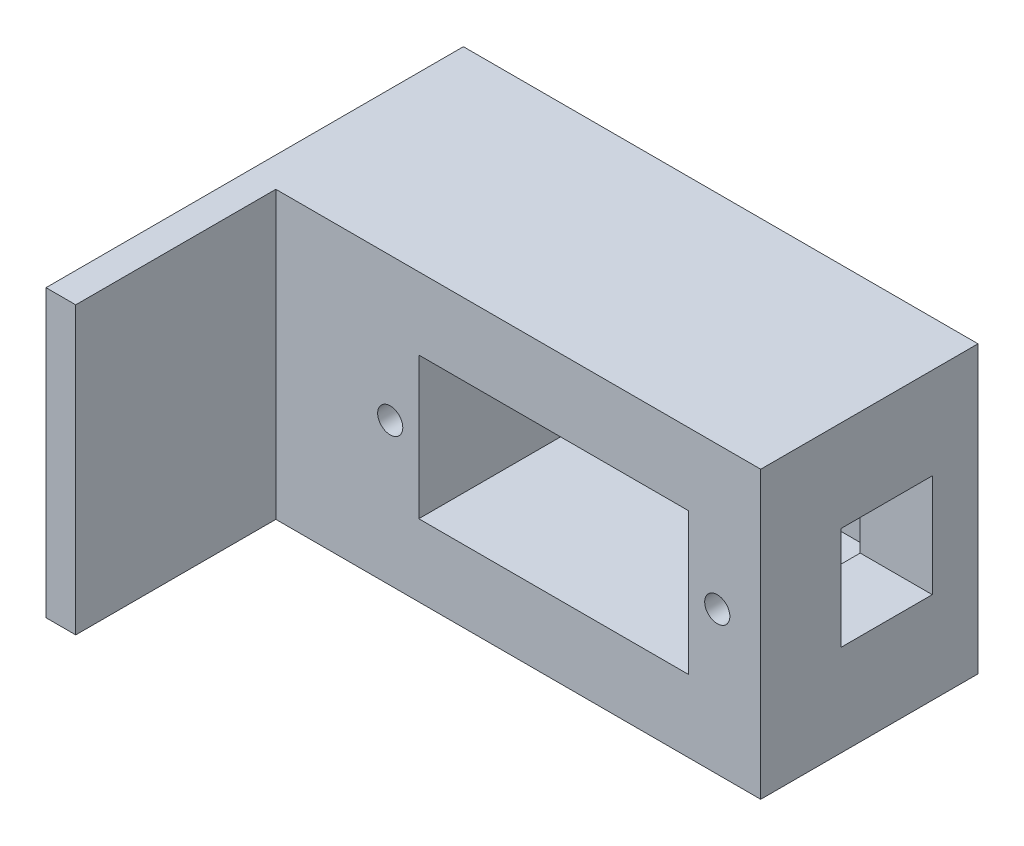
ISO-10303-21;
HEADER;
FILE_DESCRIPTION(('STEP AP214'),'2;1');
FILE_NAME('part.step','',(''),(''),'','','');
FILE_SCHEMA(('AUTOMOTIVE_DESIGN { 1 0 10303 214 1 1 1 1 }'));
ENDSEC;
DATA;
#1=APPLICATION_CONTEXT('core data for automotive mechanical design processes');
#2=APPLICATION_PROTOCOL_DEFINITION('international standard','automotive_design',2000,#1);
#3=PRODUCT_CONTEXT('',#1,'mechanical');
#4=PRODUCT('Part','Part','',(#3));
#5=PRODUCT_RELATED_PRODUCT_CATEGORY('part','',(#4));
#6=PRODUCT_DEFINITION_FORMATION('','',#4);
#7=PRODUCT_DEFINITION_CONTEXT('part definition',#1,'design');
#8=PRODUCT_DEFINITION('design','',#6,#7);
#9=PRODUCT_DEFINITION_SHAPE('','',#8);
#10=(LENGTH_UNIT() NAMED_UNIT(*) SI_UNIT(.MILLI.,.METRE.));
#11=(NAMED_UNIT(*) PLANE_ANGLE_UNIT() SI_UNIT($,.RADIAN.));
#12=(NAMED_UNIT(*) SI_UNIT($,.STERADIAN.) SOLID_ANGLE_UNIT());
#13=UNCERTAINTY_MEASURE_WITH_UNIT(LENGTH_MEASURE(1.E-05),#10,'distance_accuracy_value','');
#14=(GEOMETRIC_REPRESENTATION_CONTEXT(3) GLOBAL_UNCERTAINTY_ASSIGNED_CONTEXT((#13)) GLOBAL_UNIT_ASSIGNED_CONTEXT((#10,
#11,#12)) REPRESENTATION_CONTEXT('',''));
#15=CARTESIAN_POINT('',(0.,0.,0.));
#16=DIRECTION('',(0.,0.,1.));
#17=DIRECTION('',(1.,0.,0.));
#18=AXIS2_PLACEMENT_3D('',#15,#16,#17);
#19=CARTESIAN_POINT('',(-65.0289916908456,-17.09643110089,19.));
#20=DIRECTION('',(0.,1.,0.));
#21=DIRECTION('',(0.,0.,1.));
#22=AXIS2_PLACEMENT_3D('',#19,#20,#21);
#23=PLANE('',#22);
#24=DIRECTION('',(1.,0.,0.));
#25=VECTOR('',#24,1.);
#26=CARTESIAN_POINT('',(-65.0289916908456,-17.09643110089,0.));
#27=LINE('',#26,#25);
#28=CARTESIAN_POINT('',(-65.0289916908456,-17.09643110089,0.));
#29=VERTEX_POINT('',#28);
#30=CARTESIAN_POINT('',(-20.0289916908456,-17.09643110089,0.));
#31=VERTEX_POINT('',#30);
#32=EDGE_CURVE('E250',#29,#31,#27,.T.);
#33=ORIENTED_EDGE('',*,*,#32,.T.);
#34=DIRECTION('',(0.,0.,-1.));
#35=VECTOR('',#34,1.);
#36=CARTESIAN_POINT('',(-20.0289916908456,-17.09643110089,19.));
#37=LINE('',#36,#35);
#38=CARTESIAN_POINT('',(-20.0289916908456,-17.09643110089,19.));
#39=VERTEX_POINT('',#38);
#40=EDGE_CURVE('E291',#39,#31,#37,.T.);
#41=ORIENTED_EDGE('',*,*,#40,.F.);
#42=DIRECTION('',(1.,0.,0.));
#43=VECTOR('',#42,1.);
#44=CARTESIAN_POINT('',(-65.0289916908456,-17.09643110089,19.));
#45=LINE('',#44,#43);
#46=CARTESIAN_POINT('',(-62.4289916908456,-17.09643110089,19.));
#47=VERTEX_POINT('',#46);
#48=EDGE_CURVE('E160',#47,#39,#45,.T.);
#49=ORIENTED_EDGE('',*,*,#48,.F.);
#50=DIRECTION('',(0.,0.,-1.));
#51=VECTOR('',#50,1.);
#52=CARTESIAN_POINT('',(-62.4289916908456,-17.09643110089,36.5));
#53=LINE('',#52,#51);
#54=CARTESIAN_POINT('',(-62.4289916908456,-17.09643110089,36.5));
#55=VERTEX_POINT('',#54);
#56=EDGE_CURVE('E55',#55,#47,#53,.T.);
#57=ORIENTED_EDGE('',*,*,#56,.F.);
#58=DIRECTION('',(1.,0.,0.));
#59=VECTOR('',#58,1.);
#60=CARTESIAN_POINT('',(-65.0289916908456,-17.09643110089,36.5));
#61=LINE('',#60,#59);
#62=CARTESIAN_POINT('',(-65.0289916908456,-17.09643110089,36.5));
#63=VERTEX_POINT('',#62);
#64=EDGE_CURVE('E145',#63,#55,#61,.T.);
#65=ORIENTED_EDGE('',*,*,#64,.F.);
#66=DIRECTION('',(0.,0.,-1.));
#67=VECTOR('',#66,1.);
#68=CARTESIAN_POINT('',(-65.0289916908456,-17.09643110089,19.));
#69=LINE('',#68,#67);
#70=EDGE_CURVE('E270',#63,#29,#69,.T.);
#71=ORIENTED_EDGE('',*,*,#70,.T.);
#72=EDGE_LOOP('',(#33,#41,#49,#57,#65,#71));
#73=FACE_BOUND('',#72,.T.);
#74=ADVANCED_FACE('F39',(#73),#23,.F.);
#75=CARTESIAN_POINT('',(-20.0289916908456,7.90356889910998,19.));
#76=DIRECTION('',(1.,0.,0.));
#77=DIRECTION('',(0.,0.,-1.));
#78=AXIS2_PLACEMENT_3D('',#75,#76,#77);
#79=PLANE('',#78);
#80=DIRECTION('',(0.,-1.,0.));
#81=VECTOR('',#80,1.);
#82=CARTESIAN_POINT('',(-20.0289916908456,-0.0964311008900161,12.));
#83=LINE('',#82,#81);
#84=CARTESIAN_POINT('',(-20.0289916908456,-0.0964311008900161,12.));
#85=VERTEX_POINT('',#84);
#86=CARTESIAN_POINT('',(-20.0289916908456,-9.09643110089002,12.));
#87=VERTEX_POINT('',#86);
#88=EDGE_CURVE('E63',#85,#87,#83,.T.);
#89=ORIENTED_EDGE('',*,*,#88,.F.);
#90=DIRECTION('',(0.,0.,1.));
#91=VECTOR('',#90,1.);
#92=CARTESIAN_POINT('',(-20.0289916908456,-0.0964311008900161,12.));
#93=LINE('',#92,#91);
#94=CARTESIAN_POINT('',(-20.0289916908456,-0.0964311008900161,4.));
#95=VERTEX_POINT('',#94);
#96=EDGE_CURVE('E199',#95,#85,#93,.T.);
#97=ORIENTED_EDGE('',*,*,#96,.F.);
#98=DIRECTION('',(0.,1.,0.));
#99=VECTOR('',#98,1.);
#100=CARTESIAN_POINT('',(-20.0289916908456,-0.0964311008900161,4.));
#101=LINE('',#100,#99);
#102=CARTESIAN_POINT('',(-20.0289916908456,-9.09643110089002,4.));
#103=VERTEX_POINT('',#102);
#104=EDGE_CURVE('E195',#103,#95,#101,.T.);
#105=ORIENTED_EDGE('',*,*,#104,.F.);
#106=DIRECTION('',(0.,0.,-1.));
#107=VECTOR('',#106,1.);
#108=CARTESIAN_POINT('',(-20.0289916908456,-9.09643110089002,12.));
#109=LINE('',#108,#107);
#110=EDGE_CURVE('E191',#87,#103,#109,.T.);
#111=ORIENTED_EDGE('',*,*,#110,.F.);
#112=EDGE_LOOP('',(#89,#97,#105,#111));
#113=FACE_BOUND('',#112,.T.);
#114=DIRECTION('',(0.,-1.,0.));
#115=VECTOR('',#114,1.);
#116=CARTESIAN_POINT('',(-20.0289916908456,7.90356889910998,0.));
#117=LINE('',#116,#115);
#118=CARTESIAN_POINT('',(-20.0289916908456,7.90356889910998,0.));
#119=VERTEX_POINT('',#118);
#120=EDGE_CURVE('E273',#119,#31,#117,.T.);
#121=ORIENTED_EDGE('',*,*,#120,.F.);
#122=DIRECTION('',(0.,0.,-1.));
#123=VECTOR('',#122,1.);
#124=CARTESIAN_POINT('',(-20.0289916908456,7.90356889910998,19.));
#125=LINE('',#124,#123);
#126=CARTESIAN_POINT('',(-20.0289916908456,7.90356889910998,19.));
#127=VERTEX_POINT('',#126);
#128=EDGE_CURVE('E288',#127,#119,#125,.T.);
#129=ORIENTED_EDGE('',*,*,#128,.F.);
#130=DIRECTION('',(0.,-1.,0.));
#131=VECTOR('',#130,1.);
#132=CARTESIAN_POINT('',(-20.0289916908456,7.90356889910998,19.));
#133=LINE('',#132,#131);
#134=EDGE_CURVE('E262',#127,#39,#133,.T.);
#135=ORIENTED_EDGE('',*,*,#134,.T.);
#136=ORIENTED_EDGE('',*,*,#40,.T.);
#137=EDGE_LOOP('',(#121,#129,#135,#136));
#138=FACE_BOUND('',#137,.T.);
#139=ADVANCED_FACE('F318',(#113,#138),#79,.T.);
#140=CARTESIAN_POINT('',(-65.0289916908456,7.90356889910998,19.));
#141=DIRECTION('',(0.,1.,0.));
#142=DIRECTION('',(0.,0.,1.));
#143=AXIS2_PLACEMENT_3D('',#140,#141,#142);
#144=PLANE('',#143);
#145=DIRECTION('',(1.,0.,0.));
#146=VECTOR('',#145,1.);
#147=CARTESIAN_POINT('',(-65.0289916908456,7.90356889910998,0.));
#148=LINE('',#147,#146);
#149=CARTESIAN_POINT('',(-65.0289916908456,7.90356889910998,0.));
#150=VERTEX_POINT('',#149);
#151=EDGE_CURVE('E277',#150,#119,#148,.T.);
#152=ORIENTED_EDGE('',*,*,#151,.F.);
#153=DIRECTION('',(0.,0.,-1.));
#154=VECTOR('',#153,1.);
#155=CARTESIAN_POINT('',(-65.0289916908456,7.90356889910998,19.));
#156=LINE('',#155,#154);
#157=CARTESIAN_POINT('',(-65.0289916908456,7.90356889910998,36.5));
#158=VERTEX_POINT('',#157);
#159=EDGE_CURVE('E285',#158,#150,#156,.T.);
#160=ORIENTED_EDGE('',*,*,#159,.F.);
#161=DIRECTION('',(1.,0.,0.));
#162=VECTOR('',#161,1.);
#163=CARTESIAN_POINT('',(-65.0289916908456,7.90356889910998,36.5));
#164=LINE('',#163,#162);
#165=CARTESIAN_POINT('',(-62.4289916908456,7.90356889910998,36.5));
#166=VERTEX_POINT('',#165);
#167=EDGE_CURVE('E167',#158,#166,#164,.T.);
#168=ORIENTED_EDGE('',*,*,#167,.T.);
#169=DIRECTION('',(0.,0.,-1.));
#170=VECTOR('',#169,1.);
#171=CARTESIAN_POINT('',(-62.4289916908456,7.90356889910998,36.5));
#172=LINE('',#171,#170);
#173=CARTESIAN_POINT('',(-62.4289916908456,7.90356889910998,19.));
#174=VERTEX_POINT('',#173);
#175=EDGE_CURVE('E163',#166,#174,#172,.T.);
#176=ORIENTED_EDGE('',*,*,#175,.T.);
#177=DIRECTION('',(1.,0.,0.));
#178=VECTOR('',#177,1.);
#179=CARTESIAN_POINT('',(-65.0289916908456,7.90356889910998,19.));
#180=LINE('',#179,#178);
#181=EDGE_CURVE('E267',#174,#127,#180,.T.);
#182=ORIENTED_EDGE('',*,*,#181,.T.);
#183=ORIENTED_EDGE('',*,*,#128,.T.);
#184=EDGE_LOOP('',(#152,#160,#168,#176,#182,#183));
#185=FACE_BOUND('',#184,.T.);
#186=ADVANCED_FACE('F341',(#185),#144,.T.);
#187=CARTESIAN_POINT('',(-65.0289916908456,7.90356889910998,19.));
#188=DIRECTION('',(1.,0.,0.));
#189=DIRECTION('',(0.,0.,-1.));
#190=AXIS2_PLACEMENT_3D('',#187,#188,#189);
#191=PLANE('',#190);
#192=DIRECTION('',(0.,-1.,0.));
#193=VECTOR('',#192,1.);
#194=CARTESIAN_POINT('',(-65.0289916908456,7.90356889910998,0.));
#195=LINE('',#194,#193);
#196=EDGE_CURVE('E263',#150,#29,#195,.T.);
#197=ORIENTED_EDGE('',*,*,#196,.T.);
#198=ORIENTED_EDGE('',*,*,#70,.F.);
#199=DIRECTION('',(0.,-1.,0.));
#200=VECTOR('',#199,1.);
#201=CARTESIAN_POINT('',(-65.0289916908456,7.90356889910998,36.5));
#202=LINE('',#201,#200);
#203=EDGE_CURVE('E151',#158,#63,#202,.T.);
#204=ORIENTED_EDGE('',*,*,#203,.F.);
#205=ORIENTED_EDGE('',*,*,#159,.T.);
#206=EDGE_LOOP('',(#197,#198,#204,#205));
#207=FACE_BOUND('',#206,.T.);
#208=ADVANCED_FACE('F345',(#207),#191,.F.);
#209=CARTESIAN_POINT('',(0.,0.,19.));
#210=DIRECTION('',(0.,0.,-1.));
#211=DIRECTION('',(-1.,0.,0.));
#212=AXIS2_PLACEMENT_3D('',#209,#210,#211);
#213=PLANE('',#212);
#214=CARTESIAN_POINT('',(-52.4289916908457,-4.59643110089002,19.));
#215=DIRECTION('',(0.,0.,1.));
#216=DIRECTION('',(1.,0.,0.));
#217=AXIS2_PLACEMENT_3D('',#214,#215,#216);
#218=CIRCLE('',#217,1.1);
#219=CARTESIAN_POINT('',(-51.3289916908457,-4.59643110089002,19.));
#220=VERTEX_POINT('',#219);
#221=EDGE_CURVE('E182',#220,#220,#218,.T.);
#222=ORIENTED_EDGE('',*,*,#221,.F.);
#223=EDGE_LOOP('',(#222));
#224=FACE_BOUND('',#223,.T.);
#225=CARTESIAN_POINT('',(-23.8289916908456,-4.59643110089002,19.));
#226=DIRECTION('',(0.,0.,1.));
#227=DIRECTION('',(1.,0.,0.));
#228=AXIS2_PLACEMENT_3D('',#225,#226,#227);
#229=CIRCLE('',#228,1.1);
#230=CARTESIAN_POINT('',(-22.7289916908456,-4.59643110089002,19.));
#231=VERTEX_POINT('',#230);
#232=EDGE_CURVE('E162',#231,#231,#229,.T.);
#233=ORIENTED_EDGE('',*,*,#232,.F.);
#234=EDGE_LOOP('',(#233));
#235=FACE_BOUND('',#234,.T.);
#236=DIRECTION('',(1.,0.,0.));
#237=VECTOR('',#236,1.);
#238=CARTESIAN_POINT('',(-49.9289916908456,-10.79643110089,19.));
#239=LINE('',#238,#237);
#240=CARTESIAN_POINT('',(-49.9289916908456,-10.79643110089,19.));
#241=VERTEX_POINT('',#240);
#242=CARTESIAN_POINT('',(-26.3289916908456,-10.79643110089,19.));
#243=VERTEX_POINT('',#242);
#244=EDGE_CURVE('E236',#241,#243,#239,.T.);
#245=ORIENTED_EDGE('',*,*,#244,.F.);
#246=DIRECTION('',(0.,-1.,0.));
#247=VECTOR('',#246,1.);
#248=CARTESIAN_POINT('',(-49.9289916908456,1.60356889910999,19.));
#249=LINE('',#248,#247);
#250=CARTESIAN_POINT('',(-49.9289916908456,1.60356889910999,19.));
#251=VERTEX_POINT('',#250);
#252=EDGE_CURVE('E207',#251,#241,#249,.T.);
#253=ORIENTED_EDGE('',*,*,#252,.F.);
#254=DIRECTION('',(-1.,0.,0.));
#255=VECTOR('',#254,1.);
#256=CARTESIAN_POINT('',(-49.9289916908456,1.60356889910999,19.));
#257=LINE('',#256,#255);
#258=CARTESIAN_POINT('',(-26.3289916908456,1.60356889910999,19.));
#259=VERTEX_POINT('',#258);
#260=EDGE_CURVE('E221',#259,#251,#257,.T.);
#261=ORIENTED_EDGE('',*,*,#260,.F.);
#262=DIRECTION('',(0.,1.,0.));
#263=VECTOR('',#262,1.);
#264=CARTESIAN_POINT('',(-26.3289916908456,1.60356889910999,19.));
#265=LINE('',#264,#263);
#266=EDGE_CURVE('E240',#243,#259,#265,.T.);
#267=ORIENTED_EDGE('',*,*,#266,.F.);
#268=EDGE_LOOP('',(#245,#253,#261,#267));
#269=FACE_BOUND('',#268,.T.);
#270=ORIENTED_EDGE('',*,*,#181,.F.);
#271=DIRECTION('',(0.,-1.,0.));
#272=VECTOR('',#271,1.);
#273=CARTESIAN_POINT('',(-62.4289916908456,7.90356889910998,19.));
#274=LINE('',#273,#272);
#275=EDGE_CURVE('E155',#174,#47,#274,.T.);
#276=ORIENTED_EDGE('',*,*,#275,.T.);
#277=ORIENTED_EDGE('',*,*,#48,.T.);
#278=ORIENTED_EDGE('',*,*,#134,.F.);
#279=EDGE_LOOP('',(#270,#276,#277,#278));
#280=FACE_BOUND('',#279,.T.);
#281=ADVANCED_FACE('F351',(#224,#235,#269,#280),#213,.F.);
#282=CARTESIAN_POINT('',(0.,0.,0.));
#283=DIRECTION('',(0.,0.,-1.));
#284=DIRECTION('',(-1.,0.,0.));
#285=AXIS2_PLACEMENT_3D('',#282,#283,#284);
#286=PLANE('',#285);
#287=ORIENTED_EDGE('',*,*,#32,.F.);
#288=ORIENTED_EDGE('',*,*,#196,.F.);
#289=ORIENTED_EDGE('',*,*,#151,.T.);
#290=ORIENTED_EDGE('',*,*,#120,.T.);
#291=EDGE_LOOP('',(#287,#288,#289,#290));
#292=FACE_BOUND('',#291,.T.);
#293=ADVANCED_FACE('F353',(#292),#286,.T.);
#294=CARTESIAN_POINT('',(-49.9289916908456,1.60356889910999,1.5));
#295=DIRECTION('',(-1.,0.,0.));
#296=DIRECTION('',(0.,0.,1.));
#297=AXIS2_PLACEMENT_3D('',#294,#295,#296);
#298=PLANE('',#297);
#299=ORIENTED_EDGE('',*,*,#252,.T.);
#300=DIRECTION('',(0.,0.,1.));
#301=VECTOR('',#300,1.);
#302=CARTESIAN_POINT('',(-49.9289916908456,-10.79643110089,1.5));
#303=LINE('',#302,#301);
#304=CARTESIAN_POINT('',(-49.9289916908456,-10.79643110089,1.5));
#305=VERTEX_POINT('',#304);
#306=EDGE_CURVE('E233',#305,#241,#303,.T.);
#307=ORIENTED_EDGE('',*,*,#306,.F.);
#308=DIRECTION('',(0.,-1.,0.));
#309=VECTOR('',#308,1.);
#310=CARTESIAN_POINT('',(-49.9289916908456,1.60356889910999,1.5));
#311=LINE('',#310,#309);
#312=CARTESIAN_POINT('',(-49.9289916908456,1.60356889910999,1.5));
#313=VERTEX_POINT('',#312);
#314=EDGE_CURVE('E216',#313,#305,#311,.T.);
#315=ORIENTED_EDGE('',*,*,#314,.F.);
#316=DIRECTION('',(0.,0.,1.));
#317=VECTOR('',#316,1.);
#318=CARTESIAN_POINT('',(-49.9289916908456,1.60356889910999,1.5));
#319=LINE('',#318,#317);
#320=EDGE_CURVE('E247',#313,#251,#319,.T.);
#321=ORIENTED_EDGE('',*,*,#320,.T.);
#322=EDGE_LOOP('',(#299,#307,#315,#321));
#323=FACE_BOUND('',#322,.T.);
#324=ADVANCED_FACE('F356',(#323),#298,.F.);
#325=CARTESIAN_POINT('',(-49.9289916908456,1.60356889910999,1.5));
#326=DIRECTION('',(0.,1.,0.));
#327=DIRECTION('',(0.,0.,1.));
#328=AXIS2_PLACEMENT_3D('',#325,#326,#327);
#329=PLANE('',#328);
#330=ORIENTED_EDGE('',*,*,#260,.T.);
#331=ORIENTED_EDGE('',*,*,#320,.F.);
#332=DIRECTION('',(-1.,0.,0.));
#333=VECTOR('',#332,1.);
#334=CARTESIAN_POINT('',(-49.9289916908456,1.60356889910999,1.5));
#335=LINE('',#334,#333);
#336=CARTESIAN_POINT('',(-26.3289916908456,1.60356889910999,1.5));
#337=VERTEX_POINT('',#336);
#338=EDGE_CURVE('E229',#337,#313,#335,.T.);
#339=ORIENTED_EDGE('',*,*,#338,.F.);
#340=DIRECTION('',(0.,0.,1.));
#341=VECTOR('',#340,1.);
#342=CARTESIAN_POINT('',(-26.3289916908456,1.60356889910999,1.5));
#343=LINE('',#342,#341);
#344=EDGE_CURVE('E251',#337,#259,#343,.T.);
#345=ORIENTED_EDGE('',*,*,#344,.T.);
#346=EDGE_LOOP('',(#330,#331,#339,#345));
#347=FACE_BOUND('',#346,.T.);
#348=ADVANCED_FACE('F363',(#347),#329,.F.);
#349=CARTESIAN_POINT('',(-26.3289916908456,1.60356889910999,1.5));
#350=DIRECTION('',(1.,0.,0.));
#351=DIRECTION('',(0.,0.,-1.));
#352=AXIS2_PLACEMENT_3D('',#349,#350,#351);
#353=PLANE('',#352);
#354=DIRECTION('',(0.,0.,1.));
#355=VECTOR('',#354,1.);
#356=CARTESIAN_POINT('',(-26.3289916908456,-0.0964311008900161,1.5));
#357=LINE('',#356,#355);
#358=CARTESIAN_POINT('',(-26.3289916908456,-0.0964311008900161,4.));
#359=VERTEX_POINT('',#358);
#360=CARTESIAN_POINT('',(-26.3289916908456,-0.0964311008900161,12.));
#361=VERTEX_POINT('',#360);
#362=EDGE_CURVE('E48',#359,#361,#357,.T.);
#363=ORIENTED_EDGE('',*,*,#362,.T.);
#364=DIRECTION('',(0.,-1.,0.));
#365=VECTOR('',#364,1.);
#366=CARTESIAN_POINT('',(-26.3289916908456,1.60356889910998,12.));
#367=LINE('',#366,#365);
#368=CARTESIAN_POINT('',(-26.3289916908456,-9.09643110089002,12.));
#369=VERTEX_POINT('',#368);
#370=EDGE_CURVE('E11',#361,#369,#367,.T.);
#371=ORIENTED_EDGE('',*,*,#370,.T.);
#372=DIRECTION('',(0.,0.,-1.));
#373=VECTOR('',#372,1.);
#374=CARTESIAN_POINT('',(-26.3289916908456,-9.09643110089002,1.5));
#375=LINE('',#374,#373);
#376=CARTESIAN_POINT('',(-26.3289916908456,-9.09643110089002,4.));
#377=VERTEX_POINT('',#376);
#378=EDGE_CURVE('E294',#369,#377,#375,.T.);
#379=ORIENTED_EDGE('',*,*,#378,.T.);
#380=DIRECTION('',(0.,1.,0.));
#381=VECTOR('',#380,1.);
#382=CARTESIAN_POINT('',(-26.3289916908456,1.60356889910998,4.));
#383=LINE('',#382,#381);
#384=EDGE_CURVE('E298',#377,#359,#383,.T.);
#385=ORIENTED_EDGE('',*,*,#384,.T.);
#386=EDGE_LOOP('',(#363,#371,#379,#385));
#387=FACE_BOUND('',#386,.T.);
#388=ORIENTED_EDGE('',*,*,#266,.T.);
#389=ORIENTED_EDGE('',*,*,#344,.F.);
#390=DIRECTION('',(0.,1.,0.));
#391=VECTOR('',#390,1.);
#392=CARTESIAN_POINT('',(-26.3289916908456,1.60356889910999,1.5));
#393=LINE('',#392,#391);
#394=CARTESIAN_POINT('',(-26.3289916908456,-10.79643110089,1.5));
#395=VERTEX_POINT('',#394);
#396=EDGE_CURVE('E225',#395,#337,#393,.T.);
#397=ORIENTED_EDGE('',*,*,#396,.F.);
#398=DIRECTION('',(0.,0.,1.));
#399=VECTOR('',#398,1.);
#400=CARTESIAN_POINT('',(-26.3289916908456,-10.79643110089,1.5));
#401=LINE('',#400,#399);
#402=EDGE_CURVE('E254',#395,#243,#401,.T.);
#403=ORIENTED_EDGE('',*,*,#402,.T.);
#404=EDGE_LOOP('',(#388,#389,#397,#403));
#405=FACE_BOUND('',#404,.T.);
#406=ADVANCED_FACE('F305',(#387,#405),#353,.F.);
#407=CARTESIAN_POINT('',(-49.9289916908456,-10.79643110089,1.5));
#408=DIRECTION('',(0.,-1.,0.));
#409=DIRECTION('',(1.,0.,0.));
#410=AXIS2_PLACEMENT_3D('',#407,#408,#409);
#411=PLANE('',#410);
#412=ORIENTED_EDGE('',*,*,#244,.T.);
#413=ORIENTED_EDGE('',*,*,#402,.F.);
#414=DIRECTION('',(1.,0.,0.));
#415=VECTOR('',#414,1.);
#416=CARTESIAN_POINT('',(-49.9289916908456,-10.79643110089,1.5));
#417=LINE('',#416,#415);
#418=EDGE_CURVE('E220',#305,#395,#417,.T.);
#419=ORIENTED_EDGE('',*,*,#418,.F.);
#420=ORIENTED_EDGE('',*,*,#306,.T.);
#421=EDGE_LOOP('',(#412,#413,#419,#420));
#422=FACE_BOUND('',#421,.T.);
#423=ADVANCED_FACE('F332',(#422),#411,.F.);
#424=CARTESIAN_POINT('',(0.,0.,1.5));
#425=DIRECTION('',(0.,0.,1.));
#426=DIRECTION('',(1.,0.,0.));
#427=AXIS2_PLACEMENT_3D('',#424,#425,#426);
#428=PLANE('',#427);
#429=ORIENTED_EDGE('',*,*,#314,.T.);
#430=ORIENTED_EDGE('',*,*,#418,.T.);
#431=ORIENTED_EDGE('',*,*,#396,.T.);
#432=ORIENTED_EDGE('',*,*,#338,.T.);
#433=EDGE_LOOP('',(#429,#430,#431,#432));
#434=FACE_BOUND('',#433,.T.);
#435=ADVANCED_FACE('F324',(#434),#428,.T.);
#436=CARTESIAN_POINT('',(-27.0289916908456,-0.0964311008900161,12.));
#437=DIRECTION('',(0.,0.,1.));
#438=DIRECTION('',(0.,-1.,0.));
#439=AXIS2_PLACEMENT_3D('',#436,#437,#438);
#440=PLANE('',#439);
#441=CARTESIAN_POINT('',(-23.8289916908456,-4.59643110089002,12.));
#442=DIRECTION('',(0.,0.,1.));
#443=DIRECTION('',(0.,-1.,0.));
#444=AXIS2_PLACEMENT_3D('',#441,#442,#443);
#445=CIRCLE('',#444,1.1);
#446=CARTESIAN_POINT('',(-23.8289916908456,-5.69643110089002,12.));
#447=VERTEX_POINT('',#446);
#448=EDGE_CURVE('E42',#447,#447,#445,.T.);
#449=ORIENTED_EDGE('',*,*,#448,.T.);
#450=EDGE_LOOP('',(#449));
#451=FACE_BOUND('',#450,.T.);
#452=DIRECTION('',(1.,0.,0.));
#453=VECTOR('',#452,1.);
#454=CARTESIAN_POINT('',(-27.0289916908456,-0.0964311008900161,12.));
#455=LINE('',#454,#453);
#456=EDGE_CURVE('E204',#361,#85,#455,.T.);
#457=ORIENTED_EDGE('',*,*,#456,.T.);
#458=ORIENTED_EDGE('',*,*,#88,.T.);
#459=DIRECTION('',(1.,0.,0.));
#460=VECTOR('',#459,1.);
#461=CARTESIAN_POINT('',(-27.0289916908456,-9.09643110089002,12.));
#462=LINE('',#461,#460);
#463=EDGE_CURVE('E203',#369,#87,#462,.T.);
#464=ORIENTED_EDGE('',*,*,#463,.F.);
#465=ORIENTED_EDGE('',*,*,#370,.F.);
#466=EDGE_LOOP('',(#457,#458,#464,#465));
#467=FACE_BOUND('',#466,.T.);
#468=ADVANCED_FACE('F322',(#451,#467),#440,.F.);
#469=CARTESIAN_POINT('',(-27.0289916908456,-0.0964311008900161,12.));
#470=DIRECTION('',(0.,1.,0.));
#471=DIRECTION('',(0.,0.,1.));
#472=AXIS2_PLACEMENT_3D('',#469,#470,#471);
#473=PLANE('',#472);
#474=DIRECTION('',(1.,0.,0.));
#475=VECTOR('',#474,1.);
#476=CARTESIAN_POINT('',(-27.0289916908456,-0.0964311008900161,4.));
#477=LINE('',#476,#475);
#478=EDGE_CURVE('E208',#359,#95,#477,.T.);
#479=ORIENTED_EDGE('',*,*,#478,.T.);
#480=ORIENTED_EDGE('',*,*,#96,.T.);
#481=ORIENTED_EDGE('',*,*,#456,.F.);
#482=ORIENTED_EDGE('',*,*,#362,.F.);
#483=EDGE_LOOP('',(#479,#480,#481,#482));
#484=FACE_BOUND('',#483,.T.);
#485=ADVANCED_FACE('F311',(#484),#473,.F.);
#486=CARTESIAN_POINT('',(-27.0289916908456,-0.0964311008900161,4.));
#487=DIRECTION('',(0.,0.,-1.));
#488=DIRECTION('',(0.,1.,0.));
#489=AXIS2_PLACEMENT_3D('',#486,#487,#488);
#490=PLANE('',#489);
#491=DIRECTION('',(1.,0.,0.));
#492=VECTOR('',#491,1.);
#493=CARTESIAN_POINT('',(-27.0289916908456,-9.09643110089002,4.));
#494=LINE('',#493,#492);
#495=EDGE_CURVE('E211',#377,#103,#494,.T.);
#496=ORIENTED_EDGE('',*,*,#495,.T.);
#497=ORIENTED_EDGE('',*,*,#104,.T.);
#498=ORIENTED_EDGE('',*,*,#478,.F.);
#499=ORIENTED_EDGE('',*,*,#384,.F.);
#500=EDGE_LOOP('',(#496,#497,#498,#499));
#501=FACE_BOUND('',#500,.T.);
#502=ADVANCED_FACE('F313',(#501),#490,.F.);
#503=CARTESIAN_POINT('',(-27.0289916908456,-9.09643110089002,12.));
#504=DIRECTION('',(0.,-1.,0.));
#505=DIRECTION('',(0.,0.,-1.));
#506=AXIS2_PLACEMENT_3D('',#503,#504,#505);
#507=PLANE('',#506);
#508=ORIENTED_EDGE('',*,*,#463,.T.);
#509=ORIENTED_EDGE('',*,*,#110,.T.);
#510=ORIENTED_EDGE('',*,*,#495,.F.);
#511=ORIENTED_EDGE('',*,*,#378,.F.);
#512=EDGE_LOOP('',(#508,#509,#510,#511));
#513=FACE_BOUND('',#512,.T.);
#514=ADVANCED_FACE('F321',(#513),#507,.F.);
#515=CARTESIAN_POINT('',(-23.8289916908456,-4.59643110089002,11.5));
#516=DIRECTION('',(0.,0.,1.));
#517=DIRECTION('',(1.,0.,0.));
#518=AXIS2_PLACEMENT_3D('',#515,#516,#517);
#519=CYLINDRICAL_SURFACE('',#518,1.1);
#520=ORIENTED_EDGE('',*,*,#232,.T.);
#521=EDGE_LOOP('',(#520));
#522=FACE_BOUND('',#521,.T.);
#523=ORIENTED_EDGE('',*,*,#448,.F.);
#524=EDGE_LOOP('',(#523));
#525=FACE_BOUND('',#524,.T.);
#526=ADVANCED_FACE('F481',(#522,#525),#519,.F.);
#527=CARTESIAN_POINT('',(-52.4289916908457,-4.59643110089002,11.5));
#528=DIRECTION('',(0.,0.,1.));
#529=DIRECTION('',(1.,0.,0.));
#530=AXIS2_PLACEMENT_3D('',#527,#528,#529);
#531=CYLINDRICAL_SURFACE('',#530,1.1);
#532=CARTESIAN_POINT('',(-52.4289916908457,-4.59643110089002,11.5));
#533=DIRECTION('',(0.,0.,1.));
#534=DIRECTION('',(1.,0.,0.));
#535=AXIS2_PLACEMENT_3D('',#532,#533,#534);
#536=CIRCLE('',#535,1.1);
#537=CARTESIAN_POINT('',(-51.3289916908457,-4.59643110089002,11.5));
#538=VERTEX_POINT('',#537);
#539=EDGE_CURVE('E178',#538,#538,#536,.T.);
#540=ORIENTED_EDGE('',*,*,#539,.F.);
#541=EDGE_LOOP('',(#540));
#542=FACE_BOUND('',#541,.T.);
#543=ORIENTED_EDGE('',*,*,#221,.T.);
#544=EDGE_LOOP('',(#543));
#545=FACE_BOUND('',#544,.T.);
#546=ADVANCED_FACE('F470',(#542,#545),#531,.F.);
#547=CARTESIAN_POINT('',(-52.4289916908457,-4.59643110089002,11.5));
#548=DIRECTION('',(0.,0.,1.));
#549=DIRECTION('',(1.,0.,0.));
#550=AXIS2_PLACEMENT_3D('',#547,#548,#549);
#551=PLANE('',#550);
#552=ORIENTED_EDGE('',*,*,#539,.T.);
#553=EDGE_LOOP('',(#552));
#554=FACE_BOUND('',#553,.T.);
#555=ADVANCED_FACE('F466',(#554),#551,.T.);
#556=CARTESIAN_POINT('',(-62.4289916908456,7.90356889910998,36.5));
#557=DIRECTION('',(1.,0.,0.));
#558=DIRECTION('',(0.,0.,-1.));
#559=AXIS2_PLACEMENT_3D('',#556,#557,#558);
#560=PLANE('',#559);
#561=ORIENTED_EDGE('',*,*,#275,.F.);
#562=ORIENTED_EDGE('',*,*,#175,.F.);
#563=DIRECTION('',(0.,-1.,0.));
#564=VECTOR('',#563,1.);
#565=CARTESIAN_POINT('',(-62.4289916908456,7.90356889910998,36.5));
#566=LINE('',#565,#564);
#567=EDGE_CURVE('E148',#166,#55,#566,.T.);
#568=ORIENTED_EDGE('',*,*,#567,.T.);
#569=ORIENTED_EDGE('',*,*,#56,.T.);
#570=EDGE_LOOP('',(#561,#562,#568,#569));
#571=FACE_BOUND('',#570,.T.);
#572=ADVANCED_FACE('F165',(#571),#560,.T.);
#573=CARTESIAN_POINT('',(0.,0.,36.5));
#574=DIRECTION('',(0.,0.,-1.));
#575=DIRECTION('',(-1.,0.,0.));
#576=AXIS2_PLACEMENT_3D('',#573,#574,#575);
#577=PLANE('',#576);
#578=ORIENTED_EDGE('',*,*,#64,.T.);
#579=ORIENTED_EDGE('',*,*,#567,.F.);
#580=ORIENTED_EDGE('',*,*,#167,.F.);
#581=ORIENTED_EDGE('',*,*,#203,.T.);
#582=EDGE_LOOP('',(#578,#579,#580,#581));
#583=FACE_BOUND('',#582,.T.);
#584=ADVANCED_FACE('F146',(#583),#577,.F.);
#585=CLOSED_SHELL('',(#74,#139,#186,#208,#281,#293,#324,#348,#406,#423,#435,#468,#485,#502,#514,
#526,#546,#555,#572,#584));
#586=MANIFOLD_SOLID_BREP('B2',#585);
#587=ADVANCED_BREP_SHAPE_REPRESENTATION('',(#18,#586),#14);
#588=SHAPE_DEFINITION_REPRESENTATION(#9,#587);
ENDSEC;
END-ISO-10303-21;
